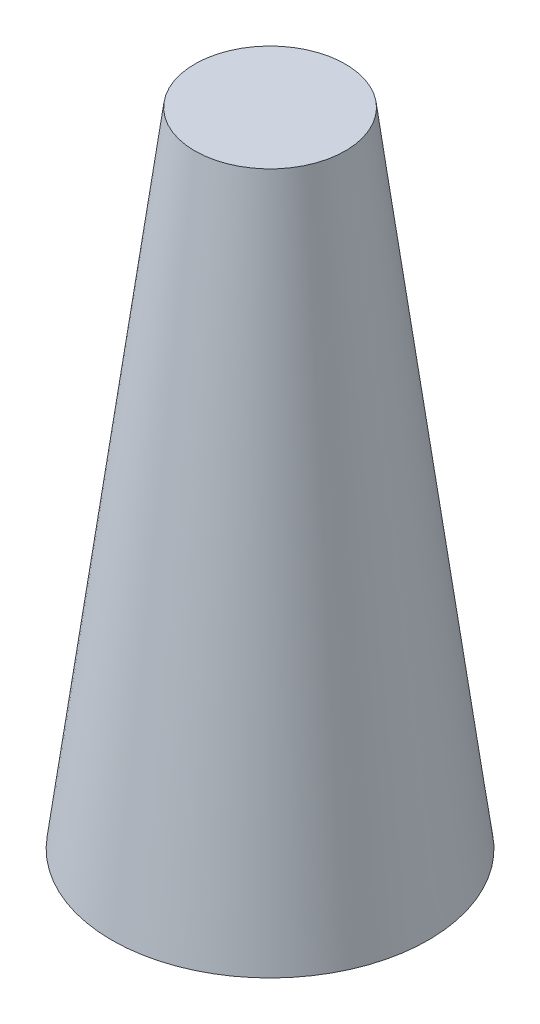
ISO-10303-21;
HEADER;
FILE_DESCRIPTION(('STEP AP214'),'2;1');
FILE_NAME('part.step','',(''),(''),'','','');
FILE_SCHEMA(('AUTOMOTIVE_DESIGN { 1 0 10303 214 1 1 1 1 }'));
ENDSEC;
DATA;
#1=APPLICATION_CONTEXT('core data for automotive mechanical design processes');
#2=APPLICATION_PROTOCOL_DEFINITION('international standard','automotive_design',2000,#1);
#3=PRODUCT_CONTEXT('',#1,'mechanical');
#4=PRODUCT('Part','Part','',(#3));
#5=PRODUCT_RELATED_PRODUCT_CATEGORY('part','',(#4));
#6=PRODUCT_DEFINITION_FORMATION('','',#4);
#7=PRODUCT_DEFINITION_CONTEXT('part definition',#1,'design');
#8=PRODUCT_DEFINITION('design','',#6,#7);
#9=PRODUCT_DEFINITION_SHAPE('','',#8);
#10=(LENGTH_UNIT() NAMED_UNIT(*) SI_UNIT(.MILLI.,.METRE.));
#11=(NAMED_UNIT(*) PLANE_ANGLE_UNIT() SI_UNIT($,.RADIAN.));
#12=(NAMED_UNIT(*) SI_UNIT($,.STERADIAN.) SOLID_ANGLE_UNIT());
#13=UNCERTAINTY_MEASURE_WITH_UNIT(LENGTH_MEASURE(1.E-05),#10,'distance_accuracy_value','');
#14=(GEOMETRIC_REPRESENTATION_CONTEXT(3) GLOBAL_UNCERTAINTY_ASSIGNED_CONTEXT((#13)) GLOBAL_UNIT_ASSIGNED_CONTEXT((#10,
#11,#12)) REPRESENTATION_CONTEXT('',''));
#15=CARTESIAN_POINT('',(0.,0.,0.));
#16=DIRECTION('',(0.,0.,1.));
#17=DIRECTION('',(1.,0.,0.));
#18=AXIS2_PLACEMENT_3D('',#15,#16,#17);
#19=CARTESIAN_POINT('',(0.,510.8,0.));
#20=DIRECTION('',(0.,1.,0.));
#21=DIRECTION('',(0.,0.,1.));
#22=AXIS2_PLACEMENT_3D('',#19,#20,#21);
#23=PLANE('',#22);
#24=CARTESIAN_POINT('',(0.,510.8,0.));
#25=DIRECTION('',(0.,1.,0.));
#26=DIRECTION('',(0.,0.,1.));
#27=AXIS2_PLACEMENT_3D('',#24,#25,#26);
#28=CIRCLE('',#27,59.9);
#29=CARTESIAN_POINT('',(0.,510.8,59.9));
#30=VERTEX_POINT('',#29);
#31=EDGE_CURVE('E11',#30,#30,#28,.T.);
#32=ORIENTED_EDGE('',*,*,#31,.T.);
#33=EDGE_LOOP('',(#32));
#34=FACE_BOUND('',#33,.T.);
#35=ADVANCED_FACE('F37',(#34),#23,.T.);
#36=CARTESIAN_POINT('',(0.,0.,0.));
#37=DIRECTION('',(0.,1.,0.));
#38=DIRECTION('',(0.,0.,1.));
#39=AXIS2_PLACEMENT_3D('',#36,#37,#38);
#40=PLANE('',#39);
#41=CARTESIAN_POINT('',(0.,0.,0.));
#42=DIRECTION('',(0.,1.,0.));
#43=DIRECTION('',(0.,0.,1.));
#44=AXIS2_PLACEMENT_3D('',#41,#42,#43);
#45=CIRCLE('',#44,126.);
#46=CARTESIAN_POINT('',(0.,0.,126.));
#47=VERTEX_POINT('',#46);
#48=EDGE_CURVE('E45',#47,#47,#45,.T.);
#49=ORIENTED_EDGE('',*,*,#48,.F.);
#50=EDGE_LOOP('',(#49));
#51=FACE_BOUND('',#50,.T.);
#52=ADVANCED_FACE('F68',(#51),#40,.F.);
#53=CARTESIAN_POINT('',(0.,510.8,0.));
#54=DIRECTION('',(0.,-1.,0.));
#55=DIRECTION('',(0.,0.,-1.));
#56=AXIS2_PLACEMENT_3D('',#53,#54,#55);
#57=CONICAL_SURFACE('',#56,59.9,0.128689705506796);
#58=ORIENTED_EDGE('',*,*,#48,.T.);
#59=EDGE_LOOP('',(#58));
#60=FACE_BOUND('',#59,.T.);
#61=ORIENTED_EDGE('',*,*,#31,.F.);
#62=EDGE_LOOP('',(#61));
#63=FACE_BOUND('',#62,.T.);
#64=ADVANCED_FACE('F76',(#60,#63),#57,.T.);
#65=CLOSED_SHELL('',(#35,#52,#64));
#66=MANIFOLD_SOLID_BREP('B2',#65);
#67=ADVANCED_BREP_SHAPE_REPRESENTATION('',(#18,#66),#14);
#68=SHAPE_DEFINITION_REPRESENTATION(#9,#67);
ENDSEC;
END-ISO-10303-21;
